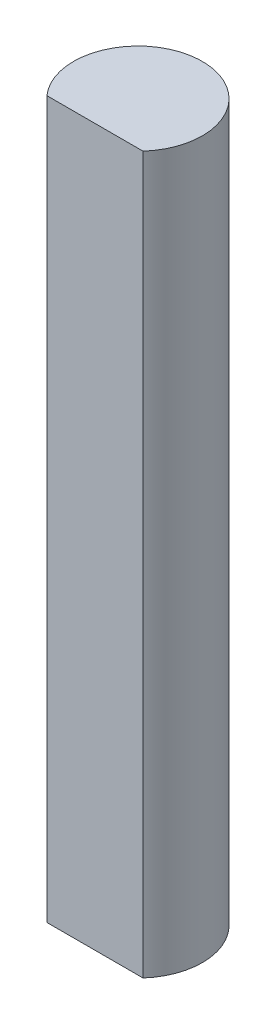
ISO-10303-21;
HEADER;
FILE_DESCRIPTION(('STEP AP214'),'2;1');
FILE_NAME('part.step','',(''),(''),'','','');
FILE_SCHEMA(('AUTOMOTIVE_DESIGN { 1 0 10303 214 1 1 1 1 }'));
ENDSEC;
DATA;
#1=APPLICATION_CONTEXT('core data for automotive mechanical design processes');
#2=APPLICATION_PROTOCOL_DEFINITION('international standard','automotive_design',2000,#1);
#3=PRODUCT_CONTEXT('',#1,'mechanical');
#4=PRODUCT('Part','Part','',(#3));
#5=PRODUCT_RELATED_PRODUCT_CATEGORY('part','',(#4));
#6=PRODUCT_DEFINITION_FORMATION('','',#4);
#7=PRODUCT_DEFINITION_CONTEXT('part definition',#1,'design');
#8=PRODUCT_DEFINITION('design','',#6,#7);
#9=PRODUCT_DEFINITION_SHAPE('','',#8);
#10=(LENGTH_UNIT() NAMED_UNIT(*) SI_UNIT(.MILLI.,.METRE.));
#11=(NAMED_UNIT(*) PLANE_ANGLE_UNIT() SI_UNIT($,.RADIAN.));
#12=(NAMED_UNIT(*) SI_UNIT($,.STERADIAN.) SOLID_ANGLE_UNIT());
#13=UNCERTAINTY_MEASURE_WITH_UNIT(LENGTH_MEASURE(1.E-05),#10,'distance_accuracy_value','');
#14=(GEOMETRIC_REPRESENTATION_CONTEXT(3) GLOBAL_UNCERTAINTY_ASSIGNED_CONTEXT((#13)) GLOBAL_UNIT_ASSIGNED_CONTEXT((#10,
#11,#12)) REPRESENTATION_CONTEXT('',''));
#15=CARTESIAN_POINT('',(0.,0.,0.));
#16=DIRECTION('',(0.,0.,1.));
#17=DIRECTION('',(1.,0.,0.));
#18=AXIS2_PLACEMENT_3D('',#15,#16,#17);
#19=CARTESIAN_POINT('',(0.,25.,0.));
#20=DIRECTION('',(0.,-1.,0.));
#21=DIRECTION('',(0.,0.,-1.));
#22=AXIS2_PLACEMENT_3D('',#19,#20,#21);
#23=CYLINDRICAL_SURFACE('',#22,2.25);
#24=CARTESIAN_POINT('',(0.,25.,0.));
#25=DIRECTION('',(0.,1.,0.));
#26=DIRECTION('',(0.,0.,1.));
#27=AXIS2_PLACEMENT_3D('',#24,#25,#26);
#28=CIRCLE('',#27,2.25);
#29=CARTESIAN_POINT('',(1.67705098312484,25.,1.5));
#30=VERTEX_POINT('',#29);
#31=CARTESIAN_POINT('',(-1.67705098312484,25.,1.5));
#32=VERTEX_POINT('',#31);
#33=EDGE_CURVE('E40',#30,#32,#28,.T.);
#34=ORIENTED_EDGE('',*,*,#33,.F.);
#35=DIRECTION('',(0.,-1.,0.));
#36=VECTOR('',#35,1.);
#37=CARTESIAN_POINT('',(1.67705098312484,25.,1.5));
#38=LINE('',#37,#36);
#39=CARTESIAN_POINT('',(1.67705098312484,0.,1.5));
#40=VERTEX_POINT('',#39);
#41=EDGE_CURVE('E54',#30,#40,#38,.T.);
#42=ORIENTED_EDGE('',*,*,#41,.T.);
#43=CARTESIAN_POINT('',(0.,0.,0.));
#44=DIRECTION('',(0.,1.,0.));
#45=DIRECTION('',(0.,0.,1.));
#46=AXIS2_PLACEMENT_3D('',#43,#44,#45);
#47=CIRCLE('',#46,2.25);
#48=CARTESIAN_POINT('',(-1.67705098312484,0.,1.5));
#49=VERTEX_POINT('',#48);
#50=EDGE_CURVE('E62',#40,#49,#47,.T.);
#51=ORIENTED_EDGE('',*,*,#50,.T.);
#52=DIRECTION('',(0.,-1.,0.));
#53=VECTOR('',#52,1.);
#54=CARTESIAN_POINT('',(-1.67705098312484,25.,1.5));
#55=LINE('',#54,#53);
#56=EDGE_CURVE('E47',#49,#32,#55,.F.);
#57=ORIENTED_EDGE('',*,*,#56,.T.);
#58=EDGE_LOOP('',(#34,#42,#51,#57));
#59=FACE_BOUND('',#58,.T.);
#60=ADVANCED_FACE('F33',(#59),#23,.T.);
#61=CARTESIAN_POINT('',(0.,25.,0.));
#62=DIRECTION('',(0.,1.,0.));
#63=DIRECTION('',(0.,0.,1.));
#64=AXIS2_PLACEMENT_3D('',#61,#62,#63);
#65=PLANE('',#64);
#66=DIRECTION('',(-1.,0.,0.));
#67=VECTOR('',#66,1.);
#68=CARTESIAN_POINT('',(-2.31256844437411,25.,1.5));
#69=LINE('',#68,#67);
#70=EDGE_CURVE('E57',#30,#32,#69,.T.);
#71=ORIENTED_EDGE('',*,*,#70,.F.);
#72=ORIENTED_EDGE('',*,*,#33,.T.);
#73=EDGE_LOOP('',(#71,#72));
#74=FACE_BOUND('',#73,.T.);
#75=ADVANCED_FACE('F66',(#74),#65,.T.);
#76=CARTESIAN_POINT('',(0.,0.,0.));
#77=DIRECTION('',(0.,1.,0.));
#78=DIRECTION('',(0.,0.,1.));
#79=AXIS2_PLACEMENT_3D('',#76,#77,#78);
#80=PLANE('',#79);
#81=ORIENTED_EDGE('',*,*,#50,.F.);
#82=DIRECTION('',(-1.,0.,0.));
#83=VECTOR('',#82,1.);
#84=CARTESIAN_POINT('',(0.,0.,1.5));
#85=LINE('',#84,#83);
#86=EDGE_CURVE('E11',#40,#49,#85,.T.);
#87=ORIENTED_EDGE('',*,*,#86,.T.);
#88=EDGE_LOOP('',(#81,#87));
#89=FACE_BOUND('',#88,.T.);
#90=ADVANCED_FACE('F71',(#89),#80,.F.);
#91=CARTESIAN_POINT('',(-2.31256844437411,0.,1.5));
#92=DIRECTION('',(0.,0.,-1.));
#93=DIRECTION('',(-1.,0.,0.));
#94=AXIS2_PLACEMENT_3D('',#91,#92,#93);
#95=PLANE('',#94);
#96=ORIENTED_EDGE('',*,*,#70,.T.);
#97=ORIENTED_EDGE('',*,*,#56,.F.);
#98=ORIENTED_EDGE('',*,*,#86,.F.);
#99=ORIENTED_EDGE('',*,*,#41,.F.);
#100=EDGE_LOOP('',(#96,#97,#98,#99));
#101=FACE_BOUND('',#100,.T.);
#102=ADVANCED_FACE('F56',(#101),#95,.F.);
#103=CLOSED_SHELL('',(#60,#75,#90,#102));
#104=MANIFOLD_SOLID_BREP('B2',#103);
#105=ADVANCED_BREP_SHAPE_REPRESENTATION('',(#18,#104),#14);
#106=SHAPE_DEFINITION_REPRESENTATION(#9,#105);
ENDSEC;
END-ISO-10303-21;
